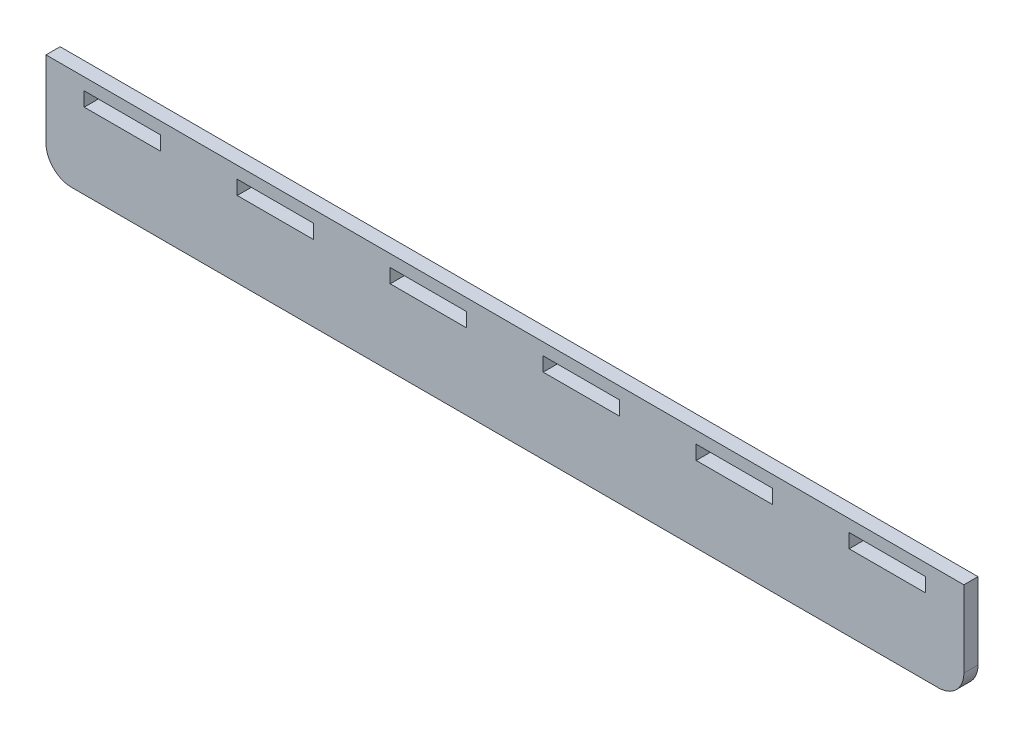
ISO-10303-21;
HEADER;
FILE_DESCRIPTION(('STEP AP214'),'2;1');
FILE_NAME('part.step','',(''),(''),'','','');
FILE_SCHEMA(('AUTOMOTIVE_DESIGN { 1 0 10303 214 1 1 1 1 }'));
ENDSEC;
DATA;
#1=APPLICATION_CONTEXT('core data for automotive mechanical design processes');
#2=APPLICATION_PROTOCOL_DEFINITION('international standard','automotive_design',2000,#1);
#3=PRODUCT_CONTEXT('',#1,'mechanical');
#4=PRODUCT('Part','Part','',(#3));
#5=PRODUCT_RELATED_PRODUCT_CATEGORY('part','',(#4));
#6=PRODUCT_DEFINITION_FORMATION('','',#4);
#7=PRODUCT_DEFINITION_CONTEXT('part definition',#1,'design');
#8=PRODUCT_DEFINITION('design','',#6,#7);
#9=PRODUCT_DEFINITION_SHAPE('','',#8);
#10=(LENGTH_UNIT() NAMED_UNIT(*) SI_UNIT(.MILLI.,.METRE.));
#11=(NAMED_UNIT(*) PLANE_ANGLE_UNIT() SI_UNIT($,.RADIAN.));
#12=(NAMED_UNIT(*) SI_UNIT($,.STERADIAN.) SOLID_ANGLE_UNIT());
#13=UNCERTAINTY_MEASURE_WITH_UNIT(LENGTH_MEASURE(1.E-05),#10,'distance_accuracy_value','');
#14=(GEOMETRIC_REPRESENTATION_CONTEXT(3) GLOBAL_UNCERTAINTY_ASSIGNED_CONTEXT((#13)) GLOBAL_UNIT_ASSIGNED_CONTEXT((#10,
#11,#12)) REPRESENTATION_CONTEXT('',''));
#15=CARTESIAN_POINT('',(0.,0.,0.));
#16=DIRECTION('',(0.,0.,1.));
#17=DIRECTION('',(1.,0.,0.));
#18=AXIS2_PLACEMENT_3D('',#15,#16,#17);
#19=CARTESIAN_POINT('',(59.4746021183339,0.,5.54));
#20=DIRECTION('',(-1.,0.,0.));
#21=DIRECTION('',(0.,0.,1.));
#22=AXIS2_PLACEMENT_3D('',#19,#20,#21);
#23=PLANE('',#22);
#24=DIRECTION('',(0.,1.,0.));
#25=VECTOR('',#24,1.);
#26=CARTESIAN_POINT('',(59.4746021183339,0.,0.));
#27=LINE('',#26,#25);
#28=CARTESIAN_POINT('',(59.4746021183339,-14.8539602394224,0.));
#29=VERTEX_POINT('',#28);
#30=CARTESIAN_POINT('',(59.4746021183339,15.1460397605776,0.));
#31=VERTEX_POINT('',#30);
#32=EDGE_CURVE('E458',#29,#31,#27,.T.);
#33=ORIENTED_EDGE('',*,*,#32,.F.);
#34=DIRECTION('',(0.,0.,-1.));
#35=VECTOR('',#34,1.);
#36=CARTESIAN_POINT('',(59.4746021183339,-14.8539602394224,5.54));
#37=LINE('',#36,#35);
#38=CARTESIAN_POINT('',(59.4746021183339,-14.8539602394224,5.54));
#39=VERTEX_POINT('',#38);
#40=EDGE_CURVE('E11',#29,#39,#37,.F.);
#41=ORIENTED_EDGE('',*,*,#40,.T.);
#42=DIRECTION('',(0.,1.,0.));
#43=VECTOR('',#42,1.);
#44=CARTESIAN_POINT('',(59.4746021183339,0.,5.54));
#45=LINE('',#44,#43);
#46=CARTESIAN_POINT('',(59.4746021183339,15.1460397605776,5.54));
#47=VERTEX_POINT('',#46);
#48=EDGE_CURVE('E352',#39,#47,#45,.T.);
#49=ORIENTED_EDGE('',*,*,#48,.T.);
#50=DIRECTION('',(0.,0.,-1.));
#51=VECTOR('',#50,1.);
#52=CARTESIAN_POINT('',(59.4746021183339,15.1460397605776,5.54));
#53=LINE('',#52,#51);
#54=EDGE_CURVE('E470',#47,#31,#53,.T.);
#55=ORIENTED_EDGE('',*,*,#54,.T.);
#56=EDGE_LOOP('',(#33,#41,#49,#55));
#57=FACE_BOUND('',#56,.T.);
#58=ADVANCED_FACE('F43',(#57),#23,.T.);
#59=CARTESIAN_POINT('',(0.,-24.8539602394224,5.54));
#60=DIRECTION('',(0.,1.,0.));
#61=DIRECTION('',(-1.,0.,0.));
#62=AXIS2_PLACEMENT_3D('',#59,#60,#61);
#63=PLANE('',#62);
#64=DIRECTION('',(1.,0.,0.));
#65=VECTOR('',#64,1.);
#66=CARTESIAN_POINT('',(0.,-24.8539602394224,0.));
#67=LINE('',#66,#65);
#68=CARTESIAN_POINT('',(69.4746021183339,-24.8539602394224,0.));
#69=VERTEX_POINT('',#68);
#70=CARTESIAN_POINT('',(409.474602118334,-24.8539602394224,0.));
#71=VERTEX_POINT('',#70);
#72=EDGE_CURVE('E461',#69,#71,#67,.T.);
#73=ORIENTED_EDGE('',*,*,#72,.T.);
#74=DIRECTION('',(0.,0.,-1.));
#75=VECTOR('',#74,1.);
#76=CARTESIAN_POINT('',(409.474602118334,-24.8539602394224,5.54));
#77=LINE('',#76,#75);
#78=CARTESIAN_POINT('',(409.474602118334,-24.8539602394224,5.54));
#79=VERTEX_POINT('',#78);
#80=EDGE_CURVE('E65',#71,#79,#77,.F.);
#81=ORIENTED_EDGE('',*,*,#80,.T.);
#82=DIRECTION('',(1.,0.,0.));
#83=VECTOR('',#82,1.);
#84=CARTESIAN_POINT('',(0.,-24.8539602394224,5.54));
#85=LINE('',#84,#83);
#86=CARTESIAN_POINT('',(69.4746021183339,-24.8539602394224,5.54));
#87=VERTEX_POINT('',#86);
#88=EDGE_CURVE('E355',#87,#79,#85,.T.);
#89=ORIENTED_EDGE('',*,*,#88,.F.);
#90=DIRECTION('',(0.,0.,-1.));
#91=VECTOR('',#90,1.);
#92=CARTESIAN_POINT('',(69.4746021183339,-24.8539602394224,0.));
#93=LINE('',#92,#91);
#94=EDGE_CURVE('E560',#87,#69,#93,.T.);
#95=ORIENTED_EDGE('',*,*,#94,.T.);
#96=EDGE_LOOP('',(#73,#81,#89,#95));
#97=FACE_BOUND('',#96,.T.);
#98=ADVANCED_FACE('F584',(#97),#63,.F.);
#99=CARTESIAN_POINT('',(419.474602118334,0.,5.54));
#100=DIRECTION('',(-1.,0.,0.));
#101=DIRECTION('',(0.,0.,1.));
#102=AXIS2_PLACEMENT_3D('',#99,#100,#101);
#103=PLANE('',#102);
#104=DIRECTION('',(0.,1.,0.));
#105=VECTOR('',#104,1.);
#106=CARTESIAN_POINT('',(419.474602118334,0.,5.54));
#107=LINE('',#106,#105);
#108=CARTESIAN_POINT('',(419.474602118334,-14.8539602394224,5.54));
#109=VERTEX_POINT('',#108);
#110=CARTESIAN_POINT('',(419.474602118334,15.1460397605776,5.54));
#111=VERTEX_POINT('',#110);
#112=EDGE_CURVE('E358',#109,#111,#107,.T.);
#113=ORIENTED_EDGE('',*,*,#112,.F.);
#114=DIRECTION('',(0.,0.,-1.));
#115=VECTOR('',#114,1.);
#116=CARTESIAN_POINT('',(419.474602118334,-14.8539602394224,5.54));
#117=LINE('',#116,#115);
#118=CARTESIAN_POINT('',(419.474602118334,-14.8539602394224,0.));
#119=VERTEX_POINT('',#118);
#120=EDGE_CURVE('E479',#109,#119,#117,.T.);
#121=ORIENTED_EDGE('',*,*,#120,.T.);
#122=DIRECTION('',(0.,1.,0.));
#123=VECTOR('',#122,1.);
#124=CARTESIAN_POINT('',(419.474602118334,0.,0.));
#125=LINE('',#124,#123);
#126=CARTESIAN_POINT('',(419.474602118334,15.1460397605776,0.));
#127=VERTEX_POINT('',#126);
#128=EDGE_CURVE('E464',#119,#127,#125,.T.);
#129=ORIENTED_EDGE('',*,*,#128,.T.);
#130=DIRECTION('',(0.,0.,-1.));
#131=VECTOR('',#130,1.);
#132=CARTESIAN_POINT('',(419.474602118334,15.1460397605776,5.54));
#133=LINE('',#132,#131);
#134=EDGE_CURVE('E474',#111,#127,#133,.T.);
#135=ORIENTED_EDGE('',*,*,#134,.F.);
#136=EDGE_LOOP('',(#113,#121,#129,#135));
#137=FACE_BOUND('',#136,.T.);
#138=ADVANCED_FACE('F577',(#137),#103,.F.);
#139=CARTESIAN_POINT('',(374.474602118334,0.,5.54));
#140=DIRECTION('',(1.,0.,0.));
#141=DIRECTION('',(0.,0.,-1.));
#142=AXIS2_PLACEMENT_3D('',#139,#140,#141);
#143=PLANE('',#142);
#144=DIRECTION('',(0.,-1.,0.));
#145=VECTOR('',#144,1.);
#146=CARTESIAN_POINT('',(374.474602118334,0.,0.));
#147=LINE('',#146,#145);
#148=CARTESIAN_POINT('',(374.474602118334,10.4160397605772,0.));
#149=VERTEX_POINT('',#148);
#150=CARTESIAN_POINT('',(374.474602118334,4.87603976057718,0.));
#151=VERTEX_POINT('',#150);
#152=EDGE_CURVE('E442',#149,#151,#147,.T.);
#153=ORIENTED_EDGE('',*,*,#152,.F.);
#154=DIRECTION('',(0.,0.,-1.));
#155=VECTOR('',#154,1.);
#156=CARTESIAN_POINT('',(374.474602118334,10.4160397605772,5.54));
#157=LINE('',#156,#155);
#158=CARTESIAN_POINT('',(374.474602118334,10.4160397605772,5.54));
#159=VERTEX_POINT('',#158);
#160=EDGE_CURVE('E475',#159,#149,#157,.T.);
#161=ORIENTED_EDGE('',*,*,#160,.F.);
#162=DIRECTION('',(0.,-1.,0.));
#163=VECTOR('',#162,1.);
#164=CARTESIAN_POINT('',(374.474602118334,0.,5.54));
#165=LINE('',#164,#163);
#166=CARTESIAN_POINT('',(374.474602118334,4.87603976057718,5.54));
#167=VERTEX_POINT('',#166);
#168=EDGE_CURVE('E337',#159,#167,#165,.T.);
#169=ORIENTED_EDGE('',*,*,#168,.T.);
#170=DIRECTION('',(0.,0.,-1.));
#171=VECTOR('',#170,1.);
#172=CARTESIAN_POINT('',(374.474602118334,4.87603976057718,5.54));
#173=LINE('',#172,#171);
#174=EDGE_CURVE('E480',#167,#151,#173,.T.);
#175=ORIENTED_EDGE('',*,*,#174,.T.);
#176=EDGE_LOOP('',(#153,#161,#169,#175));
#177=FACE_BOUND('',#176,.T.);
#178=ADVANCED_FACE('F625',(#177),#143,.T.);
#179=CARTESIAN_POINT('',(0.,10.4160397605772,5.54));
#180=DIRECTION('',(0.,1.,0.));
#181=DIRECTION('',(0.,0.,1.));
#182=AXIS2_PLACEMENT_3D('',#179,#180,#181);
#183=PLANE('',#182);
#184=DIRECTION('',(1.,0.,0.));
#185=VECTOR('',#184,1.);
#186=CARTESIAN_POINT('',(0.,10.4160397605772,0.));
#187=LINE('',#186,#185);
#188=CARTESIAN_POINT('',(404.474602118334,10.4160397605772,0.));
#189=VERTEX_POINT('',#188);
#190=EDGE_CURVE('E446',#149,#189,#187,.T.);
#191=ORIENTED_EDGE('',*,*,#190,.T.);
#192=DIRECTION('',(0.,0.,-1.));
#193=VECTOR('',#192,1.);
#194=CARTESIAN_POINT('',(404.474602118334,10.4160397605772,5.54));
#195=LINE('',#194,#193);
#196=CARTESIAN_POINT('',(404.474602118334,10.4160397605772,5.54));
#197=VERTEX_POINT('',#196);
#198=EDGE_CURVE('E487',#197,#189,#195,.T.);
#199=ORIENTED_EDGE('',*,*,#198,.F.);
#200=DIRECTION('',(1.,0.,0.));
#201=VECTOR('',#200,1.);
#202=CARTESIAN_POINT('',(0.,10.4160397605772,5.54));
#203=LINE('',#202,#201);
#204=EDGE_CURVE('E341',#159,#197,#203,.T.);
#205=ORIENTED_EDGE('',*,*,#204,.F.);
#206=ORIENTED_EDGE('',*,*,#160,.T.);
#207=EDGE_LOOP('',(#191,#199,#205,#206));
#208=FACE_BOUND('',#207,.T.);
#209=ADVANCED_FACE('F621',(#208),#183,.F.);
#210=CARTESIAN_POINT('',(404.474602118334,0.,5.54));
#211=DIRECTION('',(1.,0.,0.));
#212=DIRECTION('',(0.,0.,-1.));
#213=AXIS2_PLACEMENT_3D('',#210,#211,#212);
#214=PLANE('',#213);
#215=DIRECTION('',(0.,-1.,0.));
#216=VECTOR('',#215,1.);
#217=CARTESIAN_POINT('',(404.474602118334,0.,0.));
#218=LINE('',#217,#216);
#219=CARTESIAN_POINT('',(404.474602118334,4.87603976057718,0.));
#220=VERTEX_POINT('',#219);
#221=EDGE_CURVE('E450',#189,#220,#218,.T.);
#222=ORIENTED_EDGE('',*,*,#221,.T.);
#223=DIRECTION('',(0.,0.,-1.));
#224=VECTOR('',#223,1.);
#225=CARTESIAN_POINT('',(404.474602118334,4.87603976057718,5.54));
#226=LINE('',#225,#224);
#227=CARTESIAN_POINT('',(404.474602118334,4.87603976057718,5.54));
#228=VERTEX_POINT('',#227);
#229=EDGE_CURVE('E483',#228,#220,#226,.T.);
#230=ORIENTED_EDGE('',*,*,#229,.F.);
#231=DIRECTION('',(0.,-1.,0.));
#232=VECTOR('',#231,1.);
#233=CARTESIAN_POINT('',(404.474602118334,0.,5.54));
#234=LINE('',#233,#232);
#235=EDGE_CURVE('E345',#197,#228,#234,.T.);
#236=ORIENTED_EDGE('',*,*,#235,.F.);
#237=ORIENTED_EDGE('',*,*,#198,.T.);
#238=EDGE_LOOP('',(#222,#230,#236,#237));
#239=FACE_BOUND('',#238,.T.);
#240=ADVANCED_FACE('F617',(#239),#214,.F.);
#241=CARTESIAN_POINT('',(314.474602118334,0.,5.54));
#242=DIRECTION('',(1.,0.,0.));
#243=DIRECTION('',(0.,0.,-1.));
#244=AXIS2_PLACEMENT_3D('',#241,#242,#243);
#245=PLANE('',#244);
#246=DIRECTION('',(0.,-1.,0.));
#247=VECTOR('',#246,1.);
#248=CARTESIAN_POINT('',(314.474602118334,0.,0.));
#249=LINE('',#248,#247);
#250=CARTESIAN_POINT('',(314.474602118334,10.4160397605772,0.));
#251=VERTEX_POINT('',#250);
#252=CARTESIAN_POINT('',(314.474602118334,4.87603976057718,0.));
#253=VERTEX_POINT('',#252);
#254=EDGE_CURVE('E426',#251,#253,#249,.T.);
#255=ORIENTED_EDGE('',*,*,#254,.F.);
#256=DIRECTION('',(0.,0.,-1.));
#257=VECTOR('',#256,1.);
#258=CARTESIAN_POINT('',(314.474602118334,10.4160397605772,5.54));
#259=LINE('',#258,#257);
#260=CARTESIAN_POINT('',(314.474602118334,10.4160397605772,5.54));
#261=VERTEX_POINT('',#260);
#262=EDGE_CURVE('E484',#261,#251,#259,.T.);
#263=ORIENTED_EDGE('',*,*,#262,.F.);
#264=DIRECTION('',(0.,-1.,0.));
#265=VECTOR('',#264,1.);
#266=CARTESIAN_POINT('',(314.474602118334,0.,5.54));
#267=LINE('',#266,#265);
#268=CARTESIAN_POINT('',(314.474602118334,4.87603976057718,5.54));
#269=VERTEX_POINT('',#268);
#270=EDGE_CURVE('E322',#261,#269,#267,.T.);
#271=ORIENTED_EDGE('',*,*,#270,.T.);
#272=DIRECTION('',(0.,0.,-1.));
#273=VECTOR('',#272,1.);
#274=CARTESIAN_POINT('',(314.474602118334,4.87603976057718,5.54));
#275=LINE('',#274,#273);
#276=EDGE_CURVE('E493',#269,#253,#275,.T.);
#277=ORIENTED_EDGE('',*,*,#276,.T.);
#278=EDGE_LOOP('',(#255,#263,#271,#277));
#279=FACE_BOUND('',#278,.T.);
#280=ADVANCED_FACE('F620',(#279),#245,.T.);
#281=CARTESIAN_POINT('',(0.,10.4160397605772,5.54));
#282=DIRECTION('',(0.,1.,0.));
#283=DIRECTION('',(0.,0.,1.));
#284=AXIS2_PLACEMENT_3D('',#281,#282,#283);
#285=PLANE('',#284);
#286=DIRECTION('',(1.,0.,0.));
#287=VECTOR('',#286,1.);
#288=CARTESIAN_POINT('',(0.,10.4160397605772,0.));
#289=LINE('',#288,#287);
#290=CARTESIAN_POINT('',(344.474602118334,10.4160397605772,0.));
#291=VERTEX_POINT('',#290);
#292=EDGE_CURVE('E430',#251,#291,#289,.T.);
#293=ORIENTED_EDGE('',*,*,#292,.T.);
#294=DIRECTION('',(0.,0.,-1.));
#295=VECTOR('',#294,1.);
#296=CARTESIAN_POINT('',(344.474602118334,10.4160397605772,5.54));
#297=LINE('',#296,#295);
#298=CARTESIAN_POINT('',(344.474602118334,10.4160397605772,5.54));
#299=VERTEX_POINT('',#298);
#300=EDGE_CURVE('E500',#299,#291,#297,.T.);
#301=ORIENTED_EDGE('',*,*,#300,.F.);
#302=DIRECTION('',(1.,0.,0.));
#303=VECTOR('',#302,1.);
#304=CARTESIAN_POINT('',(0.,10.4160397605772,5.54));
#305=LINE('',#304,#303);
#306=EDGE_CURVE('E326',#261,#299,#305,.T.);
#307=ORIENTED_EDGE('',*,*,#306,.F.);
#308=ORIENTED_EDGE('',*,*,#262,.T.);
#309=EDGE_LOOP('',(#293,#301,#307,#308));
#310=FACE_BOUND('',#309,.T.);
#311=ADVANCED_FACE('F638',(#310),#285,.F.);
#312=CARTESIAN_POINT('',(344.474602118334,0.,5.54));
#313=DIRECTION('',(1.,0.,0.));
#314=DIRECTION('',(0.,0.,-1.));
#315=AXIS2_PLACEMENT_3D('',#312,#313,#314);
#316=PLANE('',#315);
#317=DIRECTION('',(0.,-1.,0.));
#318=VECTOR('',#317,1.);
#319=CARTESIAN_POINT('',(344.474602118334,0.,0.));
#320=LINE('',#319,#318);
#321=CARTESIAN_POINT('',(344.474602118334,4.87603976057718,0.));
#322=VERTEX_POINT('',#321);
#323=EDGE_CURVE('E434',#291,#322,#320,.T.);
#324=ORIENTED_EDGE('',*,*,#323,.T.);
#325=DIRECTION('',(0.,0.,-1.));
#326=VECTOR('',#325,1.);
#327=CARTESIAN_POINT('',(344.474602118334,4.87603976057718,5.54));
#328=LINE('',#327,#326);
#329=CARTESIAN_POINT('',(344.474602118334,4.87603976057718,5.54));
#330=VERTEX_POINT('',#329);
#331=EDGE_CURVE('E496',#330,#322,#328,.T.);
#332=ORIENTED_EDGE('',*,*,#331,.F.);
#333=DIRECTION('',(0.,-1.,0.));
#334=VECTOR('',#333,1.);
#335=CARTESIAN_POINT('',(344.474602118334,0.,5.54));
#336=LINE('',#335,#334);
#337=EDGE_CURVE('E330',#299,#330,#336,.T.);
#338=ORIENTED_EDGE('',*,*,#337,.F.);
#339=ORIENTED_EDGE('',*,*,#300,.T.);
#340=EDGE_LOOP('',(#324,#332,#338,#339));
#341=FACE_BOUND('',#340,.T.);
#342=ADVANCED_FACE('F634',(#341),#316,.F.);
#343=CARTESIAN_POINT('',(254.474602118334,0.,5.54));
#344=DIRECTION('',(1.,0.,0.));
#345=DIRECTION('',(0.,0.,-1.));
#346=AXIS2_PLACEMENT_3D('',#343,#344,#345);
#347=PLANE('',#346);
#348=DIRECTION('',(0.,-1.,0.));
#349=VECTOR('',#348,1.);
#350=CARTESIAN_POINT('',(254.474602118334,0.,0.));
#351=LINE('',#350,#349);
#352=CARTESIAN_POINT('',(254.474602118334,10.4160397605772,0.));
#353=VERTEX_POINT('',#352);
#354=CARTESIAN_POINT('',(254.474602118334,4.87603976057718,0.));
#355=VERTEX_POINT('',#354);
#356=EDGE_CURVE('E410',#353,#355,#351,.T.);
#357=ORIENTED_EDGE('',*,*,#356,.F.);
#358=DIRECTION('',(0.,0.,-1.));
#359=VECTOR('',#358,1.);
#360=CARTESIAN_POINT('',(254.474602118334,10.4160397605772,5.54));
#361=LINE('',#360,#359);
#362=CARTESIAN_POINT('',(254.474602118334,10.4160397605772,5.54));
#363=VERTEX_POINT('',#362);
#364=EDGE_CURVE('E497',#363,#353,#361,.T.);
#365=ORIENTED_EDGE('',*,*,#364,.F.);
#366=DIRECTION('',(0.,-1.,0.));
#367=VECTOR('',#366,1.);
#368=CARTESIAN_POINT('',(254.474602118334,0.,5.54));
#369=LINE('',#368,#367);
#370=CARTESIAN_POINT('',(254.474602118334,4.87603976057718,5.54));
#371=VERTEX_POINT('',#370);
#372=EDGE_CURVE('E307',#363,#371,#369,.T.);
#373=ORIENTED_EDGE('',*,*,#372,.T.);
#374=DIRECTION('',(0.,0.,-1.));
#375=VECTOR('',#374,1.);
#376=CARTESIAN_POINT('',(254.474602118334,4.87603976057718,5.54));
#377=LINE('',#376,#375);
#378=EDGE_CURVE('E506',#371,#355,#377,.T.);
#379=ORIENTED_EDGE('',*,*,#378,.T.);
#380=EDGE_LOOP('',(#357,#365,#373,#379));
#381=FACE_BOUND('',#380,.T.);
#382=ADVANCED_FACE('F637',(#381),#347,.T.);
#383=CARTESIAN_POINT('',(0.,10.4160397605772,5.54));
#384=DIRECTION('',(0.,1.,0.));
#385=DIRECTION('',(0.,0.,1.));
#386=AXIS2_PLACEMENT_3D('',#383,#384,#385);
#387=PLANE('',#386);
#388=DIRECTION('',(1.,0.,0.));
#389=VECTOR('',#388,1.);
#390=CARTESIAN_POINT('',(0.,10.4160397605772,0.));
#391=LINE('',#390,#389);
#392=CARTESIAN_POINT('',(284.474602118334,10.4160397605772,0.));
#393=VERTEX_POINT('',#392);
#394=EDGE_CURVE('E414',#353,#393,#391,.T.);
#395=ORIENTED_EDGE('',*,*,#394,.T.);
#396=DIRECTION('',(0.,0.,-1.));
#397=VECTOR('',#396,1.);
#398=CARTESIAN_POINT('',(284.474602118334,10.4160397605772,5.54));
#399=LINE('',#398,#397);
#400=CARTESIAN_POINT('',(284.474602118334,10.4160397605772,5.54));
#401=VERTEX_POINT('',#400);
#402=EDGE_CURVE('E513',#401,#393,#399,.T.);
#403=ORIENTED_EDGE('',*,*,#402,.F.);
#404=DIRECTION('',(1.,0.,0.));
#405=VECTOR('',#404,1.);
#406=CARTESIAN_POINT('',(0.,10.4160397605772,5.54));
#407=LINE('',#406,#405);
#408=EDGE_CURVE('E311',#363,#401,#407,.T.);
#409=ORIENTED_EDGE('',*,*,#408,.F.);
#410=ORIENTED_EDGE('',*,*,#364,.T.);
#411=EDGE_LOOP('',(#395,#403,#409,#410));
#412=FACE_BOUND('',#411,.T.);
#413=ADVANCED_FACE('F654',(#412),#387,.F.);
#414=CARTESIAN_POINT('',(284.474602118334,0.,5.54));
#415=DIRECTION('',(1.,0.,0.));
#416=DIRECTION('',(0.,0.,-1.));
#417=AXIS2_PLACEMENT_3D('',#414,#415,#416);
#418=PLANE('',#417);
#419=DIRECTION('',(0.,-1.,0.));
#420=VECTOR('',#419,1.);
#421=CARTESIAN_POINT('',(284.474602118334,0.,0.));
#422=LINE('',#421,#420);
#423=CARTESIAN_POINT('',(284.474602118334,4.87603976057718,0.));
#424=VERTEX_POINT('',#423);
#425=EDGE_CURVE('E418',#393,#424,#422,.T.);
#426=ORIENTED_EDGE('',*,*,#425,.T.);
#427=DIRECTION('',(0.,0.,-1.));
#428=VECTOR('',#427,1.);
#429=CARTESIAN_POINT('',(284.474602118334,4.87603976057718,5.54));
#430=LINE('',#429,#428);
#431=CARTESIAN_POINT('',(284.474602118334,4.87603976057718,5.54));
#432=VERTEX_POINT('',#431);
#433=EDGE_CURVE('E509',#432,#424,#430,.T.);
#434=ORIENTED_EDGE('',*,*,#433,.F.);
#435=DIRECTION('',(0.,-1.,0.));
#436=VECTOR('',#435,1.);
#437=CARTESIAN_POINT('',(284.474602118334,0.,5.54));
#438=LINE('',#437,#436);
#439=EDGE_CURVE('E315',#401,#432,#438,.T.);
#440=ORIENTED_EDGE('',*,*,#439,.F.);
#441=ORIENTED_EDGE('',*,*,#402,.T.);
#442=EDGE_LOOP('',(#426,#434,#440,#441));
#443=FACE_BOUND('',#442,.T.);
#444=ADVANCED_FACE('F650',(#443),#418,.F.);
#445=CARTESIAN_POINT('',(194.474602118334,0.,5.54));
#446=DIRECTION('',(1.,0.,0.));
#447=DIRECTION('',(0.,0.,-1.));
#448=AXIS2_PLACEMENT_3D('',#445,#446,#447);
#449=PLANE('',#448);
#450=DIRECTION('',(0.,-1.,0.));
#451=VECTOR('',#450,1.);
#452=CARTESIAN_POINT('',(194.474602118334,0.,0.));
#453=LINE('',#452,#451);
#454=CARTESIAN_POINT('',(194.474602118334,10.4160397605772,0.));
#455=VERTEX_POINT('',#454);
#456=CARTESIAN_POINT('',(194.474602118334,4.87603976057718,0.));
#457=VERTEX_POINT('',#456);
#458=EDGE_CURVE('E394',#455,#457,#453,.T.);
#459=ORIENTED_EDGE('',*,*,#458,.F.);
#460=DIRECTION('',(0.,0.,-1.));
#461=VECTOR('',#460,1.);
#462=CARTESIAN_POINT('',(194.474602118334,10.4160397605772,5.54));
#463=LINE('',#462,#461);
#464=CARTESIAN_POINT('',(194.474602118334,10.4160397605772,5.54));
#465=VERTEX_POINT('',#464);
#466=EDGE_CURVE('E510',#465,#455,#463,.T.);
#467=ORIENTED_EDGE('',*,*,#466,.F.);
#468=DIRECTION('',(0.,-1.,0.));
#469=VECTOR('',#468,1.);
#470=CARTESIAN_POINT('',(194.474602118334,0.,5.54));
#471=LINE('',#470,#469);
#472=CARTESIAN_POINT('',(194.474602118334,4.87603976057718,5.54));
#473=VERTEX_POINT('',#472);
#474=EDGE_CURVE('E292',#465,#473,#471,.T.);
#475=ORIENTED_EDGE('',*,*,#474,.T.);
#476=DIRECTION('',(0.,0.,-1.));
#477=VECTOR('',#476,1.);
#478=CARTESIAN_POINT('',(194.474602118334,4.87603976057718,5.54));
#479=LINE('',#478,#477);
#480=EDGE_CURVE('E519',#473,#457,#479,.T.);
#481=ORIENTED_EDGE('',*,*,#480,.T.);
#482=EDGE_LOOP('',(#459,#467,#475,#481));
#483=FACE_BOUND('',#482,.T.);
#484=ADVANCED_FACE('F653',(#483),#449,.T.);
#485=CARTESIAN_POINT('',(0.,10.4160397605772,5.54));
#486=DIRECTION('',(0.,1.,0.));
#487=DIRECTION('',(0.,0.,1.));
#488=AXIS2_PLACEMENT_3D('',#485,#486,#487);
#489=PLANE('',#488);
#490=DIRECTION('',(1.,0.,0.));
#491=VECTOR('',#490,1.);
#492=CARTESIAN_POINT('',(0.,10.4160397605772,0.));
#493=LINE('',#492,#491);
#494=CARTESIAN_POINT('',(224.474602118334,10.4160397605772,0.));
#495=VERTEX_POINT('',#494);
#496=EDGE_CURVE('E398',#455,#495,#493,.T.);
#497=ORIENTED_EDGE('',*,*,#496,.T.);
#498=DIRECTION('',(0.,0.,-1.));
#499=VECTOR('',#498,1.);
#500=CARTESIAN_POINT('',(224.474602118334,10.4160397605772,5.54));
#501=LINE('',#500,#499);
#502=CARTESIAN_POINT('',(224.474602118334,10.4160397605772,5.54));
#503=VERTEX_POINT('',#502);
#504=EDGE_CURVE('E526',#503,#495,#501,.T.);
#505=ORIENTED_EDGE('',*,*,#504,.F.);
#506=DIRECTION('',(1.,0.,0.));
#507=VECTOR('',#506,1.);
#508=CARTESIAN_POINT('',(0.,10.4160397605772,5.54));
#509=LINE('',#508,#507);
#510=EDGE_CURVE('E296',#465,#503,#509,.T.);
#511=ORIENTED_EDGE('',*,*,#510,.F.);
#512=ORIENTED_EDGE('',*,*,#466,.T.);
#513=EDGE_LOOP('',(#497,#505,#511,#512));
#514=FACE_BOUND('',#513,.T.);
#515=ADVANCED_FACE('F669',(#514),#489,.F.);
#516=CARTESIAN_POINT('',(224.474602118334,0.,5.54));
#517=DIRECTION('',(1.,0.,0.));
#518=DIRECTION('',(0.,0.,-1.));
#519=AXIS2_PLACEMENT_3D('',#516,#517,#518);
#520=PLANE('',#519);
#521=DIRECTION('',(0.,-1.,0.));
#522=VECTOR('',#521,1.);
#523=CARTESIAN_POINT('',(224.474602118334,0.,0.));
#524=LINE('',#523,#522);
#525=CARTESIAN_POINT('',(224.474602118334,4.87603976057718,0.));
#526=VERTEX_POINT('',#525);
#527=EDGE_CURVE('E402',#495,#526,#524,.T.);
#528=ORIENTED_EDGE('',*,*,#527,.T.);
#529=DIRECTION('',(0.,0.,-1.));
#530=VECTOR('',#529,1.);
#531=CARTESIAN_POINT('',(224.474602118334,4.87603976057718,5.54));
#532=LINE('',#531,#530);
#533=CARTESIAN_POINT('',(224.474602118334,4.87603976057718,5.54));
#534=VERTEX_POINT('',#533);
#535=EDGE_CURVE('E522',#534,#526,#532,.T.);
#536=ORIENTED_EDGE('',*,*,#535,.F.);
#537=DIRECTION('',(0.,-1.,0.));
#538=VECTOR('',#537,1.);
#539=CARTESIAN_POINT('',(224.474602118334,0.,5.54));
#540=LINE('',#539,#538);
#541=EDGE_CURVE('E300',#503,#534,#540,.T.);
#542=ORIENTED_EDGE('',*,*,#541,.F.);
#543=ORIENTED_EDGE('',*,*,#504,.T.);
#544=EDGE_LOOP('',(#528,#536,#542,#543));
#545=FACE_BOUND('',#544,.T.);
#546=ADVANCED_FACE('F665',(#545),#520,.F.);
#547=CARTESIAN_POINT('',(134.474602118334,0.,5.54));
#548=DIRECTION('',(1.,0.,0.));
#549=DIRECTION('',(0.,0.,-1.));
#550=AXIS2_PLACEMENT_3D('',#547,#548,#549);
#551=PLANE('',#550);
#552=DIRECTION('',(0.,-1.,0.));
#553=VECTOR('',#552,1.);
#554=CARTESIAN_POINT('',(134.474602118334,0.,0.));
#555=LINE('',#554,#553);
#556=CARTESIAN_POINT('',(134.474602118334,10.4160397605772,0.));
#557=VERTEX_POINT('',#556);
#558=CARTESIAN_POINT('',(134.474602118334,4.87603976057718,0.));
#559=VERTEX_POINT('',#558);
#560=EDGE_CURVE('E378',#557,#559,#555,.T.);
#561=ORIENTED_EDGE('',*,*,#560,.F.);
#562=DIRECTION('',(0.,0.,-1.));
#563=VECTOR('',#562,1.);
#564=CARTESIAN_POINT('',(134.474602118334,10.4160397605772,5.54));
#565=LINE('',#564,#563);
#566=CARTESIAN_POINT('',(134.474602118334,10.4160397605772,5.54));
#567=VERTEX_POINT('',#566);
#568=EDGE_CURVE('E523',#567,#557,#565,.T.);
#569=ORIENTED_EDGE('',*,*,#568,.F.);
#570=DIRECTION('',(0.,-1.,0.));
#571=VECTOR('',#570,1.);
#572=CARTESIAN_POINT('',(134.474602118334,0.,5.54));
#573=LINE('',#572,#571);
#574=CARTESIAN_POINT('',(134.474602118334,4.87603976057718,5.54));
#575=VERTEX_POINT('',#574);
#576=EDGE_CURVE('E277',#567,#575,#573,.T.);
#577=ORIENTED_EDGE('',*,*,#576,.T.);
#578=DIRECTION('',(0.,0.,-1.));
#579=VECTOR('',#578,1.);
#580=CARTESIAN_POINT('',(134.474602118334,4.87603976057718,5.54));
#581=LINE('',#580,#579);
#582=EDGE_CURVE('E253',#575,#559,#581,.T.);
#583=ORIENTED_EDGE('',*,*,#582,.T.);
#584=EDGE_LOOP('',(#561,#569,#577,#583));
#585=FACE_BOUND('',#584,.T.);
#586=ADVANCED_FACE('F668',(#585),#551,.T.);
#587=CARTESIAN_POINT('',(0.,10.4160397605772,5.54));
#588=DIRECTION('',(0.,1.,0.));
#589=DIRECTION('',(0.,0.,1.));
#590=AXIS2_PLACEMENT_3D('',#587,#588,#589);
#591=PLANE('',#590);
#592=DIRECTION('',(1.,0.,0.));
#593=VECTOR('',#592,1.);
#594=CARTESIAN_POINT('',(0.,10.4160397605772,0.));
#595=LINE('',#594,#593);
#596=CARTESIAN_POINT('',(164.474602118334,10.4160397605772,0.));
#597=VERTEX_POINT('',#596);
#598=EDGE_CURVE('E382',#557,#597,#595,.T.);
#599=ORIENTED_EDGE('',*,*,#598,.T.);
#600=DIRECTION('',(0.,0.,-1.));
#601=VECTOR('',#600,1.);
#602=CARTESIAN_POINT('',(164.474602118334,10.4160397605772,5.54));
#603=LINE('',#602,#601);
#604=CARTESIAN_POINT('',(164.474602118334,10.4160397605772,5.54));
#605=VERTEX_POINT('',#604);
#606=EDGE_CURVE('E537',#605,#597,#603,.T.);
#607=ORIENTED_EDGE('',*,*,#606,.F.);
#608=DIRECTION('',(1.,0.,0.));
#609=VECTOR('',#608,1.);
#610=CARTESIAN_POINT('',(0.,10.4160397605772,5.54));
#611=LINE('',#610,#609);
#612=EDGE_CURVE('E281',#567,#605,#611,.T.);
#613=ORIENTED_EDGE('',*,*,#612,.F.);
#614=ORIENTED_EDGE('',*,*,#568,.T.);
#615=EDGE_LOOP('',(#599,#607,#613,#614));
#616=FACE_BOUND('',#615,.T.);
#617=ADVANCED_FACE('F683',(#616),#591,.F.);
#618=CARTESIAN_POINT('',(164.474602118334,0.,5.54));
#619=DIRECTION('',(1.,0.,0.));
#620=DIRECTION('',(0.,0.,-1.));
#621=AXIS2_PLACEMENT_3D('',#618,#619,#620);
#622=PLANE('',#621);
#623=DIRECTION('',(0.,-1.,0.));
#624=VECTOR('',#623,1.);
#625=CARTESIAN_POINT('',(164.474602118334,0.,0.));
#626=LINE('',#625,#624);
#627=CARTESIAN_POINT('',(164.474602118334,4.87603976057718,0.));
#628=VERTEX_POINT('',#627);
#629=EDGE_CURVE('E386',#597,#628,#626,.T.);
#630=ORIENTED_EDGE('',*,*,#629,.T.);
#631=DIRECTION('',(0.,0.,-1.));
#632=VECTOR('',#631,1.);
#633=CARTESIAN_POINT('',(164.474602118334,4.87603976057718,5.54));
#634=LINE('',#633,#632);
#635=CARTESIAN_POINT('',(164.474602118334,4.87603976057718,5.54));
#636=VERTEX_POINT('',#635);
#637=EDGE_CURVE('E534',#636,#628,#634,.T.);
#638=ORIENTED_EDGE('',*,*,#637,.F.);
#639=DIRECTION('',(0.,-1.,0.));
#640=VECTOR('',#639,1.);
#641=CARTESIAN_POINT('',(164.474602118334,0.,5.54));
#642=LINE('',#641,#640);
#643=EDGE_CURVE('E285',#605,#636,#642,.T.);
#644=ORIENTED_EDGE('',*,*,#643,.F.);
#645=ORIENTED_EDGE('',*,*,#606,.T.);
#646=EDGE_LOOP('',(#630,#638,#644,#645));
#647=FACE_BOUND('',#646,.T.);
#648=ADVANCED_FACE('F680',(#647),#622,.F.);
#649=CARTESIAN_POINT('',(0.,4.87603976057718,5.54));
#650=DIRECTION('',(0.,1.,0.));
#651=DIRECTION('',(0.,0.,1.));
#652=AXIS2_PLACEMENT_3D('',#649,#650,#651);
#653=PLANE('',#652);
#654=DIRECTION('',(1.,0.,0.));
#655=VECTOR('',#654,1.);
#656=CARTESIAN_POINT('',(0.,4.87603976057718,0.));
#657=LINE('',#656,#655);
#658=CARTESIAN_POINT('',(74.4746021183339,4.87603976057718,0.));
#659=VERTEX_POINT('',#658);
#660=CARTESIAN_POINT('',(104.474602118334,4.87603976057718,0.));
#661=VERTEX_POINT('',#660);
#662=EDGE_CURVE('E247',#659,#661,#657,.T.);
#663=ORIENTED_EDGE('',*,*,#662,.F.);
#664=DIRECTION('',(0.,0.,-1.));
#665=VECTOR('',#664,1.);
#666=CARTESIAN_POINT('',(74.4746021183339,4.87603976057718,5.54));
#667=LINE('',#666,#665);
#668=CARTESIAN_POINT('',(74.4746021183339,4.87603976057718,5.54));
#669=VERTEX_POINT('',#668);
#670=EDGE_CURVE('E242',#669,#659,#667,.T.);
#671=ORIENTED_EDGE('',*,*,#670,.F.);
#672=DIRECTION('',(1.,0.,0.));
#673=VECTOR('',#672,1.);
#674=CARTESIAN_POINT('',(0.,4.87603976057718,5.54));
#675=LINE('',#674,#673);
#676=CARTESIAN_POINT('',(104.474602118334,4.87603976057718,5.54));
#677=VERTEX_POINT('',#676);
#678=EDGE_CURVE('E245',#669,#677,#675,.T.);
#679=ORIENTED_EDGE('',*,*,#678,.T.);
#680=DIRECTION('',(0.,0.,-1.));
#681=VECTOR('',#680,1.);
#682=CARTESIAN_POINT('',(104.474602118334,4.87603976057718,5.54));
#683=LINE('',#682,#681);
#684=EDGE_CURVE('E365',#677,#661,#683,.T.);
#685=ORIENTED_EDGE('',*,*,#684,.T.);
#686=EDGE_LOOP('',(#663,#671,#679,#685));
#687=FACE_BOUND('',#686,.T.);
#688=ADVANCED_FACE('F244',(#687),#653,.T.);
#689=CARTESIAN_POINT('',(74.4746021183339,0.,5.54));
#690=DIRECTION('',(1.,0.,0.));
#691=DIRECTION('',(0.,0.,-1.));
#692=AXIS2_PLACEMENT_3D('',#689,#690,#691);
#693=PLANE('',#692);
#694=DIRECTION('',(0.,-1.,0.));
#695=VECTOR('',#694,1.);
#696=CARTESIAN_POINT('',(74.4746021183339,0.,0.));
#697=LINE('',#696,#695);
#698=CARTESIAN_POINT('',(74.4746021183339,10.4160397605772,0.));
#699=VERTEX_POINT('',#698);
#700=EDGE_CURVE('E368',#699,#659,#697,.T.);
#701=ORIENTED_EDGE('',*,*,#700,.F.);
#702=DIRECTION('',(0.,0.,-1.));
#703=VECTOR('',#702,1.);
#704=CARTESIAN_POINT('',(74.4746021183339,10.4160397605772,5.54));
#705=LINE('',#704,#703);
#706=CARTESIAN_POINT('',(74.4746021183339,10.4160397605772,5.54));
#707=VERTEX_POINT('',#706);
#708=EDGE_CURVE('E254',#707,#699,#705,.T.);
#709=ORIENTED_EDGE('',*,*,#708,.F.);
#710=DIRECTION('',(0.,-1.,0.));
#711=VECTOR('',#710,1.);
#712=CARTESIAN_POINT('',(74.4746021183339,0.,5.54));
#713=LINE('',#712,#711);
#714=EDGE_CURVE('E260',#707,#669,#713,.T.);
#715=ORIENTED_EDGE('',*,*,#714,.T.);
#716=ORIENTED_EDGE('',*,*,#670,.T.);
#717=EDGE_LOOP('',(#701,#709,#715,#716));
#718=FACE_BOUND('',#717,.T.);
#719=ADVANCED_FACE('F267',(#718),#693,.T.);
#720=CARTESIAN_POINT('',(0.,10.4160397605772,5.54));
#721=DIRECTION('',(0.,1.,0.));
#722=DIRECTION('',(0.,0.,1.));
#723=AXIS2_PLACEMENT_3D('',#720,#721,#722);
#724=PLANE('',#723);
#725=DIRECTION('',(1.,0.,0.));
#726=VECTOR('',#725,1.);
#727=CARTESIAN_POINT('',(0.,10.4160397605772,0.));
#728=LINE('',#727,#726);
#729=CARTESIAN_POINT('',(104.474602118334,10.4160397605772,0.));
#730=VERTEX_POINT('',#729);
#731=EDGE_CURVE('E371',#699,#730,#728,.T.);
#732=ORIENTED_EDGE('',*,*,#731,.T.);
#733=DIRECTION('',(0.,0.,-1.));
#734=VECTOR('',#733,1.);
#735=CARTESIAN_POINT('',(104.474602118334,10.4160397605772,5.54));
#736=LINE('',#735,#734);
#737=CARTESIAN_POINT('',(104.474602118334,10.4160397605772,5.54));
#738=VERTEX_POINT('',#737);
#739=EDGE_CURVE('E545',#738,#730,#736,.T.);
#740=ORIENTED_EDGE('',*,*,#739,.F.);
#741=DIRECTION('',(1.,0.,0.));
#742=VECTOR('',#741,1.);
#743=CARTESIAN_POINT('',(0.,10.4160397605772,5.54));
#744=LINE('',#743,#742);
#745=EDGE_CURVE('E270',#707,#738,#744,.T.);
#746=ORIENTED_EDGE('',*,*,#745,.F.);
#747=ORIENTED_EDGE('',*,*,#708,.T.);
#748=EDGE_LOOP('',(#732,#740,#746,#747));
#749=FACE_BOUND('',#748,.T.);
#750=ADVANCED_FACE('F615',(#749),#724,.F.);
#751=CARTESIAN_POINT('',(0.,4.87603976057718,5.54));
#752=DIRECTION('',(0.,1.,0.));
#753=DIRECTION('',(0.,0.,1.));
#754=AXIS2_PLACEMENT_3D('',#751,#752,#753);
#755=PLANE('',#754);
#756=DIRECTION('',(1.,0.,0.));
#757=VECTOR('',#756,1.);
#758=CARTESIAN_POINT('',(0.,4.87603976057718,0.));
#759=LINE('',#758,#757);
#760=EDGE_CURVE('E454',#151,#220,#759,.T.);
#761=ORIENTED_EDGE('',*,*,#760,.F.);
#762=ORIENTED_EDGE('',*,*,#174,.F.);
#763=DIRECTION('',(1.,0.,0.));
#764=VECTOR('',#763,1.);
#765=CARTESIAN_POINT('',(0.,4.87603976057718,5.54));
#766=LINE('',#765,#764);
#767=EDGE_CURVE('E348',#167,#228,#766,.T.);
#768=ORIENTED_EDGE('',*,*,#767,.T.);
#769=ORIENTED_EDGE('',*,*,#229,.T.);
#770=EDGE_LOOP('',(#761,#762,#768,#769));
#771=FACE_BOUND('',#770,.T.);
#772=ADVANCED_FACE('F611',(#771),#755,.T.);
#773=CARTESIAN_POINT('',(0.,4.87603976057718,5.54));
#774=DIRECTION('',(0.,1.,0.));
#775=DIRECTION('',(0.,0.,1.));
#776=AXIS2_PLACEMENT_3D('',#773,#774,#775);
#777=PLANE('',#776);
#778=DIRECTION('',(1.,0.,0.));
#779=VECTOR('',#778,1.);
#780=CARTESIAN_POINT('',(0.,4.87603976057718,0.));
#781=LINE('',#780,#779);
#782=EDGE_CURVE('E438',#253,#322,#781,.T.);
#783=ORIENTED_EDGE('',*,*,#782,.F.);
#784=ORIENTED_EDGE('',*,*,#276,.F.);
#785=DIRECTION('',(1.,0.,0.));
#786=VECTOR('',#785,1.);
#787=CARTESIAN_POINT('',(0.,4.87603976057718,5.54));
#788=LINE('',#787,#786);
#789=EDGE_CURVE('E333',#269,#330,#788,.T.);
#790=ORIENTED_EDGE('',*,*,#789,.T.);
#791=ORIENTED_EDGE('',*,*,#331,.T.);
#792=EDGE_LOOP('',(#783,#784,#790,#791));
#793=FACE_BOUND('',#792,.T.);
#794=ADVANCED_FACE('F614',(#793),#777,.T.);
#795=CARTESIAN_POINT('',(0.,4.87603976057716,5.54));
#796=DIRECTION('',(0.,1.,0.));
#797=DIRECTION('',(-1.,0.,0.));
#798=AXIS2_PLACEMENT_3D('',#795,#796,#797);
#799=PLANE('',#798);
#800=DIRECTION('',(1.,0.,0.));
#801=VECTOR('',#800,1.);
#802=CARTESIAN_POINT('',(0.,4.87603976057716,0.));
#803=LINE('',#802,#801);
#804=EDGE_CURVE('E422',#355,#424,#803,.T.);
#805=ORIENTED_EDGE('',*,*,#804,.F.);
#806=ORIENTED_EDGE('',*,*,#378,.F.);
#807=DIRECTION('',(1.,0.,0.));
#808=VECTOR('',#807,1.);
#809=CARTESIAN_POINT('',(0.,4.87603976057716,5.54));
#810=LINE('',#809,#808);
#811=EDGE_CURVE('E318',#371,#432,#810,.T.);
#812=ORIENTED_EDGE('',*,*,#811,.T.);
#813=ORIENTED_EDGE('',*,*,#433,.T.);
#814=EDGE_LOOP('',(#805,#806,#812,#813));
#815=FACE_BOUND('',#814,.T.);
#816=ADVANCED_FACE('F632',(#815),#799,.T.);
#817=CARTESIAN_POINT('',(0.,4.8760397605772,5.54));
#818=DIRECTION('',(0.,1.,0.));
#819=DIRECTION('',(-1.,0.,0.));
#820=AXIS2_PLACEMENT_3D('',#817,#818,#819);
#821=PLANE('',#820);
#822=DIRECTION('',(1.,0.,0.));
#823=VECTOR('',#822,1.);
#824=CARTESIAN_POINT('',(0.,4.8760397605772,0.));
#825=LINE('',#824,#823);
#826=EDGE_CURVE('E406',#457,#526,#825,.T.);
#827=ORIENTED_EDGE('',*,*,#826,.F.);
#828=ORIENTED_EDGE('',*,*,#480,.F.);
#829=DIRECTION('',(1.,0.,0.));
#830=VECTOR('',#829,1.);
#831=CARTESIAN_POINT('',(0.,4.8760397605772,5.54));
#832=LINE('',#831,#830);
#833=EDGE_CURVE('E303',#473,#534,#832,.T.);
#834=ORIENTED_EDGE('',*,*,#833,.T.);
#835=ORIENTED_EDGE('',*,*,#535,.T.);
#836=EDGE_LOOP('',(#827,#828,#834,#835));
#837=FACE_BOUND('',#836,.T.);
#838=ADVANCED_FACE('F648',(#837),#821,.T.);
#839=CARTESIAN_POINT('',(0.,4.87603976057718,5.54));
#840=DIRECTION('',(0.,1.,0.));
#841=DIRECTION('',(0.,0.,1.));
#842=AXIS2_PLACEMENT_3D('',#839,#840,#841);
#843=PLANE('',#842);
#844=DIRECTION('',(1.,0.,0.));
#845=VECTOR('',#844,1.);
#846=CARTESIAN_POINT('',(0.,4.87603976057718,0.));
#847=LINE('',#846,#845);
#848=EDGE_CURVE('E390',#559,#628,#847,.T.);
#849=ORIENTED_EDGE('',*,*,#848,.F.);
#850=ORIENTED_EDGE('',*,*,#582,.F.);
#851=DIRECTION('',(1.,0.,0.));
#852=VECTOR('',#851,1.);
#853=CARTESIAN_POINT('',(0.,4.87603976057718,5.54));
#854=LINE('',#853,#852);
#855=EDGE_CURVE('E288',#575,#636,#854,.T.);
#856=ORIENTED_EDGE('',*,*,#855,.T.);
#857=ORIENTED_EDGE('',*,*,#637,.T.);
#858=EDGE_LOOP('',(#849,#850,#856,#857));
#859=FACE_BOUND('',#858,.T.);
#860=ADVANCED_FACE('F599',(#859),#843,.T.);
#861=CARTESIAN_POINT('',(104.474602118334,0.,5.54));
#862=DIRECTION('',(1.,0.,0.));
#863=DIRECTION('',(0.,0.,-1.));
#864=AXIS2_PLACEMENT_3D('',#861,#862,#863);
#865=PLANE('',#864);
#866=DIRECTION('',(0.,-1.,0.));
#867=VECTOR('',#866,1.);
#868=CARTESIAN_POINT('',(104.474602118334,0.,0.));
#869=LINE('',#868,#867);
#870=EDGE_CURVE('E374',#730,#661,#869,.T.);
#871=ORIENTED_EDGE('',*,*,#870,.T.);
#872=ORIENTED_EDGE('',*,*,#684,.F.);
#873=DIRECTION('',(0.,-1.,0.));
#874=VECTOR('',#873,1.);
#875=CARTESIAN_POINT('',(104.474602118334,0.,5.54));
#876=LINE('',#875,#874);
#877=EDGE_CURVE('E262',#738,#677,#876,.T.);
#878=ORIENTED_EDGE('',*,*,#877,.F.);
#879=ORIENTED_EDGE('',*,*,#739,.T.);
#880=EDGE_LOOP('',(#871,#872,#878,#879));
#881=FACE_BOUND('',#880,.T.);
#882=ADVANCED_FACE('F592',(#881),#865,.F.);
#883=CARTESIAN_POINT('',(0.,15.1460397605776,5.54));
#884=DIRECTION('',(0.,-1.,0.));
#885=DIRECTION('',(0.,0.,-1.));
#886=AXIS2_PLACEMENT_3D('',#883,#884,#885);
#887=PLANE('',#886);
#888=DIRECTION('',(-1.,0.,0.));
#889=VECTOR('',#888,1.);
#890=CARTESIAN_POINT('',(0.,15.1460397605776,0.));
#891=LINE('',#890,#889);
#892=EDGE_CURVE('E265',#127,#31,#891,.T.);
#893=ORIENTED_EDGE('',*,*,#892,.T.);
#894=ORIENTED_EDGE('',*,*,#54,.F.);
#895=DIRECTION('',(-1.,0.,0.));
#896=VECTOR('',#895,1.);
#897=CARTESIAN_POINT('',(0.,15.1460397605776,5.54));
#898=LINE('',#897,#896);
#899=EDGE_CURVE('E361',#111,#47,#898,.T.);
#900=ORIENTED_EDGE('',*,*,#899,.F.);
#901=ORIENTED_EDGE('',*,*,#134,.T.);
#902=EDGE_LOOP('',(#893,#894,#900,#901));
#903=FACE_BOUND('',#902,.T.);
#904=ADVANCED_FACE('F590',(#903),#887,.F.);
#905=CARTESIAN_POINT('',(0.,0.,5.54));
#906=DIRECTION('',(0.,0.,1.));
#907=DIRECTION('',(1.,0.,0.));
#908=AXIS2_PLACEMENT_3D('',#905,#906,#907);
#909=PLANE('',#908);
#910=ORIENTED_EDGE('',*,*,#678,.F.);
#911=ORIENTED_EDGE('',*,*,#714,.F.);
#912=ORIENTED_EDGE('',*,*,#745,.T.);
#913=ORIENTED_EDGE('',*,*,#877,.T.);
#914=EDGE_LOOP('',(#910,#911,#912,#913));
#915=FACE_BOUND('',#914,.T.);
#916=ORIENTED_EDGE('',*,*,#576,.F.);
#917=ORIENTED_EDGE('',*,*,#612,.T.);
#918=ORIENTED_EDGE('',*,*,#643,.T.);
#919=ORIENTED_EDGE('',*,*,#855,.F.);
#920=EDGE_LOOP('',(#916,#917,#918,#919));
#921=FACE_BOUND('',#920,.T.);
#922=ORIENTED_EDGE('',*,*,#474,.F.);
#923=ORIENTED_EDGE('',*,*,#510,.T.);
#924=ORIENTED_EDGE('',*,*,#541,.T.);
#925=ORIENTED_EDGE('',*,*,#833,.F.);
#926=EDGE_LOOP('',(#922,#923,#924,#925));
#927=FACE_BOUND('',#926,.T.);
#928=ORIENTED_EDGE('',*,*,#372,.F.);
#929=ORIENTED_EDGE('',*,*,#408,.T.);
#930=ORIENTED_EDGE('',*,*,#439,.T.);
#931=ORIENTED_EDGE('',*,*,#811,.F.);
#932=EDGE_LOOP('',(#928,#929,#930,#931));
#933=FACE_BOUND('',#932,.T.);
#934=ORIENTED_EDGE('',*,*,#270,.F.);
#935=ORIENTED_EDGE('',*,*,#306,.T.);
#936=ORIENTED_EDGE('',*,*,#337,.T.);
#937=ORIENTED_EDGE('',*,*,#789,.F.);
#938=EDGE_LOOP('',(#934,#935,#936,#937));
#939=FACE_BOUND('',#938,.T.);
#940=ORIENTED_EDGE('',*,*,#168,.F.);
#941=ORIENTED_EDGE('',*,*,#204,.T.);
#942=ORIENTED_EDGE('',*,*,#235,.T.);
#943=ORIENTED_EDGE('',*,*,#767,.F.);
#944=EDGE_LOOP('',(#940,#941,#942,#943));
#945=FACE_BOUND('',#944,.T.);
#946=ORIENTED_EDGE('',*,*,#88,.T.);
#947=CARTESIAN_POINT('',(409.474602118334,-14.8539602394224,5.54));
#948=DIRECTION('',(0.,0.,1.));
#949=DIRECTION('',(1.,0.,0.));
#950=AXIS2_PLACEMENT_3D('',#947,#948,#949);
#951=CIRCLE('',#950,10.);
#952=EDGE_CURVE('E52',#79,#109,#951,.T.);
#953=ORIENTED_EDGE('',*,*,#952,.T.);
#954=ORIENTED_EDGE('',*,*,#112,.T.);
#955=ORIENTED_EDGE('',*,*,#899,.T.);
#956=ORIENTED_EDGE('',*,*,#48,.F.);
#957=CARTESIAN_POINT('',(69.4746021183339,-14.8539602394224,5.54));
#958=DIRECTION('',(0.,0.,1.));
#959=DIRECTION('',(1.,0.,0.));
#960=AXIS2_PLACEMENT_3D('',#957,#958,#959);
#961=CIRCLE('',#960,10.);
#962=EDGE_CURVE('E566',#39,#87,#961,.T.);
#963=ORIENTED_EDGE('',*,*,#962,.T.);
#964=EDGE_LOOP('',(#946,#953,#954,#955,#956,#963));
#965=FACE_BOUND('',#964,.T.);
#966=ADVANCED_FACE('F258',(#915,#921,#927,#933,#939,#945,#965),#909,.T.);
#967=CARTESIAN_POINT('',(0.,0.,0.));
#968=DIRECTION('',(0.,0.,1.));
#969=DIRECTION('',(1.,0.,0.));
#970=AXIS2_PLACEMENT_3D('',#967,#968,#969);
#971=PLANE('',#970);
#972=ORIENTED_EDGE('',*,*,#662,.T.);
#973=ORIENTED_EDGE('',*,*,#870,.F.);
#974=ORIENTED_EDGE('',*,*,#731,.F.);
#975=ORIENTED_EDGE('',*,*,#700,.T.);
#976=EDGE_LOOP('',(#972,#973,#974,#975));
#977=FACE_BOUND('',#976,.T.);
#978=ORIENTED_EDGE('',*,*,#560,.T.);
#979=ORIENTED_EDGE('',*,*,#848,.T.);
#980=ORIENTED_EDGE('',*,*,#629,.F.);
#981=ORIENTED_EDGE('',*,*,#598,.F.);
#982=EDGE_LOOP('',(#978,#979,#980,#981));
#983=FACE_BOUND('',#982,.T.);
#984=ORIENTED_EDGE('',*,*,#458,.T.);
#985=ORIENTED_EDGE('',*,*,#826,.T.);
#986=ORIENTED_EDGE('',*,*,#527,.F.);
#987=ORIENTED_EDGE('',*,*,#496,.F.);
#988=EDGE_LOOP('',(#984,#985,#986,#987));
#989=FACE_BOUND('',#988,.T.);
#990=ORIENTED_EDGE('',*,*,#356,.T.);
#991=ORIENTED_EDGE('',*,*,#804,.T.);
#992=ORIENTED_EDGE('',*,*,#425,.F.);
#993=ORIENTED_EDGE('',*,*,#394,.F.);
#994=EDGE_LOOP('',(#990,#991,#992,#993));
#995=FACE_BOUND('',#994,.T.);
#996=ORIENTED_EDGE('',*,*,#254,.T.);
#997=ORIENTED_EDGE('',*,*,#782,.T.);
#998=ORIENTED_EDGE('',*,*,#323,.F.);
#999=ORIENTED_EDGE('',*,*,#292,.F.);
#1000=EDGE_LOOP('',(#996,#997,#998,#999));
#1001=FACE_BOUND('',#1000,.T.);
#1002=ORIENTED_EDGE('',*,*,#152,.T.);
#1003=ORIENTED_EDGE('',*,*,#760,.T.);
#1004=ORIENTED_EDGE('',*,*,#221,.F.);
#1005=ORIENTED_EDGE('',*,*,#190,.F.);
#1006=EDGE_LOOP('',(#1002,#1003,#1004,#1005));
#1007=FACE_BOUND('',#1006,.T.);
#1008=ORIENTED_EDGE('',*,*,#128,.F.);
#1009=CARTESIAN_POINT('',(409.474602118334,-14.8539602394224,0.));
#1010=DIRECTION('',(0.,0.,1.));
#1011=DIRECTION('',(1.,0.,0.));
#1012=AXIS2_PLACEMENT_3D('',#1009,#1010,#1011);
#1013=CIRCLE('',#1012,10.);
#1014=EDGE_CURVE('E557',#119,#71,#1013,.F.);
#1015=ORIENTED_EDGE('',*,*,#1014,.T.);
#1016=ORIENTED_EDGE('',*,*,#72,.F.);
#1017=CARTESIAN_POINT('',(69.4746021183339,-14.8539602394224,0.));
#1018=DIRECTION('',(0.,0.,1.));
#1019=DIRECTION('',(1.,0.,0.));
#1020=AXIS2_PLACEMENT_3D('',#1017,#1018,#1019);
#1021=CIRCLE('',#1020,10.);
#1022=EDGE_CURVE('E554',#69,#29,#1021,.F.);
#1023=ORIENTED_EDGE('',*,*,#1022,.T.);
#1024=ORIENTED_EDGE('',*,*,#32,.T.);
#1025=ORIENTED_EDGE('',*,*,#892,.F.);
#1026=EDGE_LOOP('',(#1008,#1015,#1016,#1023,#1024,#1025));
#1027=FACE_BOUND('',#1026,.T.);
#1028=ADVANCED_FACE('F582',(#977,#983,#989,#995,#1001,#1007,#1027),#971,.F.);
#1029=CARTESIAN_POINT('',(409.474602118334,-14.8539602394224,5.54));
#1030=DIRECTION('',(0.,0.,-1.));
#1031=DIRECTION('',(-1.,0.,0.));
#1032=AXIS2_PLACEMENT_3D('',#1029,#1030,#1031);
#1033=CYLINDRICAL_SURFACE('',#1032,10.);
#1034=ORIENTED_EDGE('',*,*,#952,.F.);
#1035=ORIENTED_EDGE('',*,*,#80,.F.);
#1036=ORIENTED_EDGE('',*,*,#1014,.F.);
#1037=ORIENTED_EDGE('',*,*,#120,.F.);
#1038=EDGE_LOOP('',(#1034,#1035,#1036,#1037));
#1039=FACE_BOUND('',#1038,.T.);
#1040=ADVANCED_FACE('F579',(#1039),#1033,.T.);
#1041=CARTESIAN_POINT('',(69.4746021183339,-14.8539602394224,5.54));
#1042=DIRECTION('',(0.,0.,1.));
#1043=DIRECTION('',(1.,0.,0.));
#1044=AXIS2_PLACEMENT_3D('',#1041,#1042,#1043);
#1045=CYLINDRICAL_SURFACE('',#1044,10.);
#1046=ORIENTED_EDGE('',*,*,#962,.F.);
#1047=ORIENTED_EDGE('',*,*,#40,.F.);
#1048=ORIENTED_EDGE('',*,*,#1022,.F.);
#1049=ORIENTED_EDGE('',*,*,#94,.F.);
#1050=EDGE_LOOP('',(#1046,#1047,#1048,#1049));
#1051=FACE_BOUND('',#1050,.T.);
#1052=ADVANCED_FACE('F45',(#1051),#1045,.T.);
#1053=CLOSED_SHELL('',(#58,#98,#138,#178,#209,#240,#280,#311,#342,#382,#413,#444,#484,#515,#546,
#586,#617,#648,#688,#719,#750,#772,#794,#816,#838,#860,#882,#904,#966,#1028,#1040,#1052));
#1054=MANIFOLD_SOLID_BREP('B2',#1053);
#1055=ADVANCED_BREP_SHAPE_REPRESENTATION('',(#18,#1054),#14);
#1056=SHAPE_DEFINITION_REPRESENTATION(#9,#1055);
ENDSEC;
END-ISO-10303-21;
